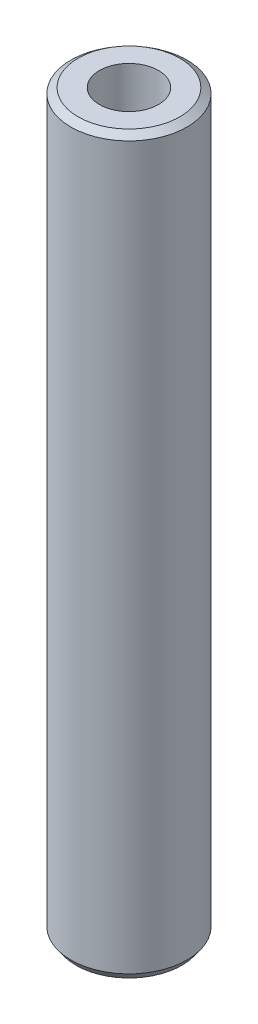
ISO-10303-21;
HEADER;
FILE_DESCRIPTION(('STEP AP214'),'2;1');
FILE_NAME('part.step','',(''),(''),'','','');
FILE_SCHEMA(('AUTOMOTIVE_DESIGN { 1 0 10303 214 1 1 1 1 }'));
ENDSEC;
DATA;
#1=APPLICATION_CONTEXT('core data for automotive mechanical design processes');
#2=APPLICATION_PROTOCOL_DEFINITION('international standard','automotive_design',2000,#1);
#3=PRODUCT_CONTEXT('',#1,'mechanical');
#4=PRODUCT('Part','Part','',(#3));
#5=PRODUCT_RELATED_PRODUCT_CATEGORY('part','',(#4));
#6=PRODUCT_DEFINITION_FORMATION('','',#4);
#7=PRODUCT_DEFINITION_CONTEXT('part definition',#1,'design');
#8=PRODUCT_DEFINITION('design','',#6,#7);
#9=PRODUCT_DEFINITION_SHAPE('','',#8);
#10=(LENGTH_UNIT() NAMED_UNIT(*) SI_UNIT(.MILLI.,.METRE.));
#11=(NAMED_UNIT(*) PLANE_ANGLE_UNIT() SI_UNIT($,.RADIAN.));
#12=(NAMED_UNIT(*) SI_UNIT($,.STERADIAN.) SOLID_ANGLE_UNIT());
#13=UNCERTAINTY_MEASURE_WITH_UNIT(LENGTH_MEASURE(1.E-05),#10,'distance_accuracy_value','');
#14=(GEOMETRIC_REPRESENTATION_CONTEXT(3) GLOBAL_UNCERTAINTY_ASSIGNED_CONTEXT((#13)) GLOBAL_UNIT_ASSIGNED_CONTEXT((#10,
#11,#12)) REPRESENTATION_CONTEXT('',''));
#15=CARTESIAN_POINT('',(0.,0.,0.));
#16=DIRECTION('',(0.,0.,1.));
#17=DIRECTION('',(1.,0.,0.));
#18=AXIS2_PLACEMENT_3D('',#15,#16,#17);
#19=CARTESIAN_POINT('',(0.,600.,0.));
#20=DIRECTION('',(0.,-1.,0.));
#21=DIRECTION('',(0.,0.,-1.));
#22=AXIS2_PLACEMENT_3D('',#19,#20,#21);
#23=CYLINDRICAL_SURFACE('',#22,47.5);
#24=CARTESIAN_POINT('',(0.,595.736422548409,0.));
#25=DIRECTION('',(0.,1.,0.));
#26=DIRECTION('',(0.,0.,1.));
#27=AXIS2_PLACEMENT_3D('',#24,#25,#26);
#28=CIRCLE('',#27,47.5);
#29=CARTESIAN_POINT('',(0.,595.736422548409,47.5));
#30=VERTEX_POINT('',#29);
#31=EDGE_CURVE('E50',#30,#30,#28,.F.);
#32=ORIENTED_EDGE('',*,*,#31,.T.);
#33=EDGE_LOOP('',(#32));
#34=FACE_BOUND('',#33,.T.);
#35=CARTESIAN_POINT('',(0.,5.92519038122863,0.));
#36=DIRECTION('',(0.,1.,0.));
#37=DIRECTION('',(0.,0.,1.));
#38=AXIS2_PLACEMENT_3D('',#35,#36,#37);
#39=CIRCLE('',#38,47.5);
#40=CARTESIAN_POINT('',(0.,5.92519038122863,47.5));
#41=VERTEX_POINT('',#40);
#42=EDGE_CURVE('E51',#41,#41,#39,.T.);
#43=ORIENTED_EDGE('',*,*,#42,.T.);
#44=EDGE_LOOP('',(#43));
#45=FACE_BOUND('',#44,.T.);
#46=ADVANCED_FACE('F39',(#34,#45),#23,.T.);
#47=CARTESIAN_POINT('',(0.,600.,0.));
#48=DIRECTION('',(0.,1.,0.));
#49=DIRECTION('',(0.,0.,1.));
#50=AXIS2_PLACEMENT_3D('',#47,#48,#49);
#51=PLANE('',#50);
#52=CARTESIAN_POINT('',(0.,600.,0.));
#53=DIRECTION('',(0.,1.,0.));
#54=DIRECTION('',(0.,0.,1.));
#55=AXIS2_PLACEMENT_3D('',#52,#53,#54);
#56=CIRCLE('',#55,41.5748096187715);
#57=CARTESIAN_POINT('',(0.,600.,41.5748096187715));
#58=VERTEX_POINT('',#57);
#59=EDGE_CURVE('E54',#58,#58,#56,.T.);
#60=ORIENTED_EDGE('',*,*,#59,.T.);
#61=EDGE_LOOP('',(#60));
#62=FACE_BOUND('',#61,.T.);
#63=CARTESIAN_POINT('',(0.,600.,0.));
#64=DIRECTION('',(0.,1.,0.));
#65=DIRECTION('',(0.,0.,1.));
#66=AXIS2_PLACEMENT_3D('',#63,#64,#65);
#67=CIRCLE('',#66,24.1520428019988);
#68=CARTESIAN_POINT('',(0.,600.,24.1520428019988));
#69=VERTEX_POINT('',#68);
#70=EDGE_CURVE('E58',#69,#69,#67,.T.);
#71=ORIENTED_EDGE('',*,*,#70,.F.);
#72=EDGE_LOOP('',(#71));
#73=FACE_BOUND('',#72,.T.);
#74=ADVANCED_FACE('F69',(#62,#73),#51,.T.);
#75=CARTESIAN_POINT('',(0.,0.,0.));
#76=DIRECTION('',(0.,1.,0.));
#77=DIRECTION('',(0.,0.,1.));
#78=AXIS2_PLACEMENT_3D('',#75,#76,#77);
#79=PLANE('',#78);
#80=CARTESIAN_POINT('',(0.,0.,0.));
#81=DIRECTION('',(0.,1.,0.));
#82=DIRECTION('',(0.,0.,1.));
#83=AXIS2_PLACEMENT_3D('',#80,#81,#82);
#84=CIRCLE('',#83,43.2364225484091);
#85=CARTESIAN_POINT('',(0.,0.,43.2364225484091));
#86=VERTEX_POINT('',#85);
#87=EDGE_CURVE('E10',#86,#86,#84,.F.);
#88=ORIENTED_EDGE('',*,*,#87,.T.);
#89=EDGE_LOOP('',(#88));
#90=FACE_BOUND('',#89,.T.);
#91=CARTESIAN_POINT('',(0.,0.,0.));
#92=DIRECTION('',(0.,1.,0.));
#93=DIRECTION('',(0.,0.,1.));
#94=AXIS2_PLACEMENT_3D('',#91,#92,#93);
#95=CIRCLE('',#94,24.1520428019988);
#96=CARTESIAN_POINT('',(0.,0.,24.1520428019988));
#97=VERTEX_POINT('',#96);
#98=EDGE_CURVE('E63',#97,#97,#95,.T.);
#99=ORIENTED_EDGE('',*,*,#98,.T.);
#100=EDGE_LOOP('',(#99));
#101=FACE_BOUND('',#100,.T.);
#102=ADVANCED_FACE('F75',(#90,#101),#79,.F.);
#103=CARTESIAN_POINT('',(0.,600.,0.));
#104=DIRECTION('',(0.,-1.,0.));
#105=DIRECTION('',(0.,0.,-1.));
#106=AXIS2_PLACEMENT_3D('',#103,#104,#105);
#107=CYLINDRICAL_SURFACE('',#106,24.1520428019988);
#108=ORIENTED_EDGE('',*,*,#70,.T.);
#109=EDGE_LOOP('',(#108));
#110=FACE_BOUND('',#109,.T.);
#111=ORIENTED_EDGE('',*,*,#98,.F.);
#112=EDGE_LOOP('',(#111));
#113=FACE_BOUND('',#112,.T.);
#114=ADVANCED_FACE('F70',(#110,#113),#107,.F.);
#115=CARTESIAN_POINT('',(0.,600.,0.));
#116=DIRECTION('',(0.,-1.,0.));
#117=DIRECTION('',(0.,0.,-1.));
#118=AXIS2_PLACEMENT_3D('',#115,#116,#117);
#119=CONICAL_SURFACE('',#118,41.5748096187715,0.947057835514417);
#120=ORIENTED_EDGE('',*,*,#31,.F.);
#121=EDGE_LOOP('',(#120));
#122=FACE_BOUND('',#121,.T.);
#123=ORIENTED_EDGE('',*,*,#59,.F.);
#124=EDGE_LOOP('',(#123));
#125=FACE_BOUND('',#124,.T.);
#126=ADVANCED_FACE('F81',(#122,#125),#119,.T.);
#127=CARTESIAN_POINT('',(0.,5.92519038122863,0.));
#128=DIRECTION('',(0.,1.,0.));
#129=DIRECTION('',(0.,0.,1.));
#130=AXIS2_PLACEMENT_3D('',#127,#128,#129);
#131=CONICAL_SURFACE('',#130,47.5,0.623738491280469);
#132=ORIENTED_EDGE('',*,*,#87,.F.);
#133=EDGE_LOOP('',(#132));
#134=FACE_BOUND('',#133,.T.);
#135=ORIENTED_EDGE('',*,*,#42,.F.);
#136=EDGE_LOOP('',(#135));
#137=FACE_BOUND('',#136,.T.);
#138=ADVANCED_FACE('F45',(#134,#137),#131,.T.);
#139=CLOSED_SHELL('',(#46,#74,#102,#114,#126,#138));
#140=MANIFOLD_SOLID_BREP('B2',#139);
#141=ADVANCED_BREP_SHAPE_REPRESENTATION('',(#18,#140),#14);
#142=SHAPE_DEFINITION_REPRESENTATION(#9,#141);
ENDSEC;
END-ISO-10303-21;
